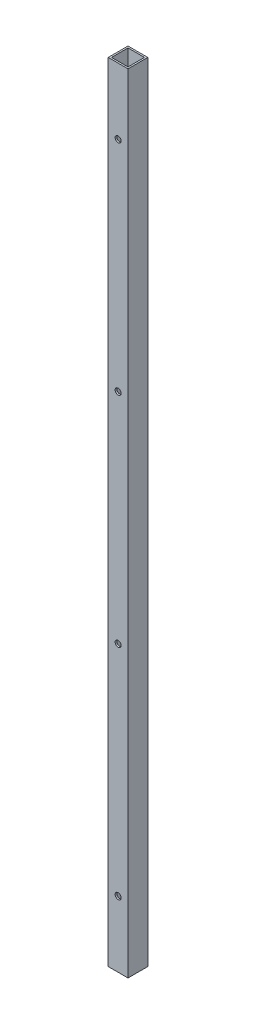
ISO-10303-21;
HEADER;
FILE_DESCRIPTION(('STEP AP214'),'2;1');
FILE_NAME('part.step','',(''),(''),'','','');
FILE_SCHEMA(('AUTOMOTIVE_DESIGN { 1 0 10303 214 1 1 1 1 }'));
ENDSEC;
DATA;
#1=APPLICATION_CONTEXT('core data for automotive mechanical design processes');
#2=APPLICATION_PROTOCOL_DEFINITION('international standard','automotive_design',2000,#1);
#3=PRODUCT_CONTEXT('',#1,'mechanical');
#4=PRODUCT('Part','Part','',(#3));
#5=PRODUCT_RELATED_PRODUCT_CATEGORY('part','',(#4));
#6=PRODUCT_DEFINITION_FORMATION('','',#4);
#7=PRODUCT_DEFINITION_CONTEXT('part definition',#1,'design');
#8=PRODUCT_DEFINITION('design','',#6,#7);
#9=PRODUCT_DEFINITION_SHAPE('','',#8);
#10=(LENGTH_UNIT() NAMED_UNIT(*) SI_UNIT(.MILLI.,.METRE.));
#11=(NAMED_UNIT(*) PLANE_ANGLE_UNIT() SI_UNIT($,.RADIAN.));
#12=(NAMED_UNIT(*) SI_UNIT($,.STERADIAN.) SOLID_ANGLE_UNIT());
#13=UNCERTAINTY_MEASURE_WITH_UNIT(LENGTH_MEASURE(1.E-05),#10,'distance_accuracy_value','');
#14=(GEOMETRIC_REPRESENTATION_CONTEXT(3) GLOBAL_UNCERTAINTY_ASSIGNED_CONTEXT((#13)) GLOBAL_UNIT_ASSIGNED_CONTEXT((#10,
#11,#12)) REPRESENTATION_CONTEXT('',''));
#15=CARTESIAN_POINT('',(0.,0.,0.));
#16=DIRECTION('',(0.,0.,1.));
#17=DIRECTION('',(1.,0.,0.));
#18=AXIS2_PLACEMENT_3D('',#15,#16,#17);
#19=CARTESIAN_POINT('',(0.,63.6015999999999,-9.525));
#20=DIRECTION('',(0.,0.,1.));
#21=DIRECTION('',(1.,0.,0.));
#22=AXIS2_PLACEMENT_3D('',#19,#20,#21);
#23=CYLINDRICAL_SURFACE('',#22,2.89559999999993);
#24=CARTESIAN_POINT('',(0.,63.6015999999999,7.93749999999999));
#25=DIRECTION('',(0.,0.,-1.));
#26=DIRECTION('',(-1.,0.,0.));
#27=AXIS2_PLACEMENT_3D('',#24,#25,#26);
#28=CIRCLE('',#27,2.89559999999993);
#29=CARTESIAN_POINT('',(-2.89559999999993,63.6015999999999,7.93749999999999));
#30=VERTEX_POINT('',#29);
#31=EDGE_CURVE('E40',#30,#30,#28,.T.);
#32=ORIENTED_EDGE('',*,*,#31,.T.);
#33=EDGE_LOOP('',(#32));
#34=FACE_BOUND('',#33,.T.);
#35=CARTESIAN_POINT('',(0.,63.6015999999999,9.525));
#36=DIRECTION('',(0.,0.,1.));
#37=DIRECTION('',(1.,0.,0.));
#38=AXIS2_PLACEMENT_3D('',#35,#36,#37);
#39=CIRCLE('',#38,2.89559999999993);
#40=CARTESIAN_POINT('',(2.89559999999993,63.6015999999999,9.525));
#41=VERTEX_POINT('',#40);
#42=EDGE_CURVE('E11',#41,#41,#39,.T.);
#43=ORIENTED_EDGE('',*,*,#42,.T.);
#44=EDGE_LOOP('',(#43));
#45=FACE_BOUND('',#44,.T.);
#46=ADVANCED_FACE('F33',(#34,#45),#23,.F.);
#47=CARTESIAN_POINT('',(0.,274.176066666667,-9.525));
#48=DIRECTION('',(0.,0.,1.));
#49=DIRECTION('',(1.,0.,0.));
#50=AXIS2_PLACEMENT_3D('',#47,#48,#49);
#51=CYLINDRICAL_SURFACE('',#50,2.89559999999993);
#52=CARTESIAN_POINT('',(0.,274.176066666667,7.93749999999999));
#53=DIRECTION('',(0.,0.,-1.));
#54=DIRECTION('',(-1.,0.,0.));
#55=AXIS2_PLACEMENT_3D('',#52,#53,#54);
#56=CIRCLE('',#55,2.89559999999993);
#57=CARTESIAN_POINT('',(-2.89559999999993,274.176066666667,7.93749999999999));
#58=VERTEX_POINT('',#57);
#59=EDGE_CURVE('E182',#58,#58,#56,.T.);
#60=ORIENTED_EDGE('',*,*,#59,.T.);
#61=EDGE_LOOP('',(#60));
#62=FACE_BOUND('',#61,.T.);
#63=CARTESIAN_POINT('',(0.,274.176066666667,9.525));
#64=DIRECTION('',(0.,0.,1.));
#65=DIRECTION('',(1.,0.,0.));
#66=AXIS2_PLACEMENT_3D('',#63,#64,#65);
#67=CIRCLE('',#66,2.89559999999993);
#68=CARTESIAN_POINT('',(2.89559999999993,274.176066666667,9.525));
#69=VERTEX_POINT('',#68);
#70=EDGE_CURVE('E185',#69,#69,#67,.T.);
#71=ORIENTED_EDGE('',*,*,#70,.T.);
#72=EDGE_LOOP('',(#71));
#73=FACE_BOUND('',#72,.T.);
#74=ADVANCED_FACE('F210',(#62,#73),#51,.F.);
#75=CARTESIAN_POINT('',(0.,63.6015999999999,-9.525));
#76=DIRECTION('',(0.,0.,1.));
#77=DIRECTION('',(1.,0.,0.));
#78=AXIS2_PLACEMENT_3D('',#75,#76,#77);
#79=CYLINDRICAL_SURFACE('',#78,2.89559999999993);
#80=CARTESIAN_POINT('',(0.,63.6015999999999,-7.9375));
#81=DIRECTION('',(0.,0.,1.));
#82=DIRECTION('',(1.,0.,0.));
#83=AXIS2_PLACEMENT_3D('',#80,#81,#82);
#84=CIRCLE('',#83,2.89559999999993);
#85=CARTESIAN_POINT('',(2.89559999999993,63.6015999999999,-7.9375));
#86=VERTEX_POINT('',#85);
#87=EDGE_CURVE('E176',#86,#86,#84,.T.);
#88=ORIENTED_EDGE('',*,*,#87,.T.);
#89=EDGE_LOOP('',(#88));
#90=FACE_BOUND('',#89,.T.);
#91=CARTESIAN_POINT('',(0.,63.6015999999999,-9.525));
#92=DIRECTION('',(0.,0.,1.));
#93=DIRECTION('',(1.,0.,0.));
#94=AXIS2_PLACEMENT_3D('',#91,#92,#93);
#95=CIRCLE('',#94,2.89559999999993);
#96=CARTESIAN_POINT('',(2.89559999999993,63.6015999999999,-9.525));
#97=VERTEX_POINT('',#96);
#98=EDGE_CURVE('E179',#97,#97,#95,.T.);
#99=ORIENTED_EDGE('',*,*,#98,.F.);
#100=EDGE_LOOP('',(#99));
#101=FACE_BOUND('',#100,.T.);
#102=ADVANCED_FACE('F214',(#90,#101),#79,.F.);
#103=CARTESIAN_POINT('',(0.,274.176066666667,-9.525));
#104=DIRECTION('',(0.,0.,1.));
#105=DIRECTION('',(1.,0.,0.));
#106=AXIS2_PLACEMENT_3D('',#103,#104,#105);
#107=CYLINDRICAL_SURFACE('',#106,2.89559999999993);
#108=CARTESIAN_POINT('',(0.,274.176066666667,-7.9375));
#109=DIRECTION('',(0.,0.,1.));
#110=DIRECTION('',(1.,0.,0.));
#111=AXIS2_PLACEMENT_3D('',#108,#109,#110);
#112=CIRCLE('',#111,2.89559999999993);
#113=CARTESIAN_POINT('',(2.89559999999993,274.176066666667,-7.9375));
#114=VERTEX_POINT('',#113);
#115=EDGE_CURVE('E166',#114,#114,#112,.T.);
#116=ORIENTED_EDGE('',*,*,#115,.T.);
#117=EDGE_LOOP('',(#116));
#118=FACE_BOUND('',#117,.T.);
#119=CARTESIAN_POINT('',(0.,274.176066666667,-9.525));
#120=DIRECTION('',(0.,0.,1.));
#121=DIRECTION('',(1.,0.,0.));
#122=AXIS2_PLACEMENT_3D('',#119,#120,#121);
#123=CIRCLE('',#122,2.89559999999993);
#124=CARTESIAN_POINT('',(2.89559999999993,274.176066666667,-9.525));
#125=VERTEX_POINT('',#124);
#126=EDGE_CURVE('E173',#125,#125,#123,.T.);
#127=ORIENTED_EDGE('',*,*,#126,.F.);
#128=EDGE_LOOP('',(#127));
#129=FACE_BOUND('',#128,.T.);
#130=ADVANCED_FACE('F219',(#118,#129),#107,.F.);
#131=CARTESIAN_POINT('',(0.,758.9266,0.));
#132=DIRECTION('',(0.,1.,0.));
#133=DIRECTION('',(0.,0.,1.));
#134=AXIS2_PLACEMENT_3D('',#131,#132,#133);
#135=PLANE('',#134);
#136=DIRECTION('',(0.,0.,-1.));
#137=VECTOR('',#136,1.);
#138=CARTESIAN_POINT('',(9.525,758.9266,-9.525));
#139=LINE('',#138,#137);
#140=CARTESIAN_POINT('',(9.525,758.9266,9.525));
#141=VERTEX_POINT('',#140);
#142=CARTESIAN_POINT('',(9.525,758.9266,-9.525));
#143=VERTEX_POINT('',#142);
#144=EDGE_CURVE('E137',#141,#143,#139,.T.);
#145=ORIENTED_EDGE('',*,*,#144,.T.);
#146=DIRECTION('',(-1.,0.,0.));
#147=VECTOR('',#146,1.);
#148=CARTESIAN_POINT('',(-9.525,758.9266,-9.525));
#149=LINE('',#148,#147);
#150=CARTESIAN_POINT('',(-9.525,758.9266,-9.525));
#151=VERTEX_POINT('',#150);
#152=EDGE_CURVE('E140',#143,#151,#149,.T.);
#153=ORIENTED_EDGE('',*,*,#152,.T.);
#154=DIRECTION('',(0.,0.,1.));
#155=VECTOR('',#154,1.);
#156=CARTESIAN_POINT('',(-9.525,758.9266,-9.525));
#157=LINE('',#156,#155);
#158=CARTESIAN_POINT('',(-9.525,758.9266,9.525));
#159=VERTEX_POINT('',#158);
#160=EDGE_CURVE('E143',#151,#159,#157,.T.);
#161=ORIENTED_EDGE('',*,*,#160,.T.);
#162=DIRECTION('',(1.,0.,0.));
#163=VECTOR('',#162,1.);
#164=CARTESIAN_POINT('',(-9.525,758.9266,9.525));
#165=LINE('',#164,#163);
#166=EDGE_CURVE('E145',#159,#141,#165,.T.);
#167=ORIENTED_EDGE('',*,*,#166,.T.);
#168=EDGE_LOOP('',(#145,#153,#161,#167));
#169=FACE_BOUND('',#168,.T.);
#170=DIRECTION('',(-1.,0.,0.));
#171=VECTOR('',#170,1.);
#172=CARTESIAN_POINT('',(-7.9375,758.9266,-7.9375));
#173=LINE('',#172,#171);
#174=CARTESIAN_POINT('',(7.9375,758.9266,-7.9375));
#175=VERTEX_POINT('',#174);
#176=CARTESIAN_POINT('',(-7.9375,758.9266,-7.9375));
#177=VERTEX_POINT('',#176);
#178=EDGE_CURVE('E105',#175,#177,#173,.T.);
#179=ORIENTED_EDGE('',*,*,#178,.F.);
#180=DIRECTION('',(0.,0.,-1.));
#181=VECTOR('',#180,1.);
#182=CARTESIAN_POINT('',(7.9375,758.9266,-7.9375));
#183=LINE('',#182,#181);
#184=CARTESIAN_POINT('',(7.9375,758.9266,7.9375));
#185=VERTEX_POINT('',#184);
#186=EDGE_CURVE('E97',#185,#175,#183,.T.);
#187=ORIENTED_EDGE('',*,*,#186,.F.);
#188=DIRECTION('',(1.,0.,0.));
#189=VECTOR('',#188,1.);
#190=CARTESIAN_POINT('',(-7.9375,758.9266,7.9375));
#191=LINE('',#190,#189);
#192=CARTESIAN_POINT('',(-7.9375,758.9266,7.9375));
#193=VERTEX_POINT('',#192);
#194=EDGE_CURVE('E121',#193,#185,#191,.T.);
#195=ORIENTED_EDGE('',*,*,#194,.F.);
#196=DIRECTION('',(0.,0.,1.));
#197=VECTOR('',#196,1.);
#198=CARTESIAN_POINT('',(-7.9375,758.9266,-7.9375));
#199=LINE('',#198,#197);
#200=EDGE_CURVE('E119',#177,#193,#199,.T.);
#201=ORIENTED_EDGE('',*,*,#200,.F.);
#202=EDGE_LOOP('',(#179,#187,#195,#201));
#203=FACE_BOUND('',#202,.T.);
#204=ADVANCED_FACE('F118',(#169,#203),#135,.T.);
#205=CARTESIAN_POINT('',(0.,0.,0.));
#206=DIRECTION('',(0.,1.,0.));
#207=DIRECTION('',(0.,0.,1.));
#208=AXIS2_PLACEMENT_3D('',#205,#206,#207);
#209=PLANE('',#208);
#210=DIRECTION('',(0.,0.,-1.));
#211=VECTOR('',#210,1.);
#212=CARTESIAN_POINT('',(9.525,0.,-9.525));
#213=LINE('',#212,#211);
#214=CARTESIAN_POINT('',(9.525,0.,9.525));
#215=VERTEX_POINT('',#214);
#216=CARTESIAN_POINT('',(9.525,0.,-9.525));
#217=VERTEX_POINT('',#216);
#218=EDGE_CURVE('E114',#215,#217,#213,.T.);
#219=ORIENTED_EDGE('',*,*,#218,.F.);
#220=DIRECTION('',(1.,0.,0.));
#221=VECTOR('',#220,1.);
#222=CARTESIAN_POINT('',(-9.525,0.,9.525));
#223=LINE('',#222,#221);
#224=CARTESIAN_POINT('',(-9.525,0.,9.525));
#225=VERTEX_POINT('',#224);
#226=EDGE_CURVE('E141',#225,#215,#223,.T.);
#227=ORIENTED_EDGE('',*,*,#226,.F.);
#228=DIRECTION('',(0.,0.,1.));
#229=VECTOR('',#228,1.);
#230=CARTESIAN_POINT('',(-9.525,0.,-9.525));
#231=LINE('',#230,#229);
#232=CARTESIAN_POINT('',(-9.525,0.,-9.525));
#233=VERTEX_POINT('',#232);
#234=EDGE_CURVE('E152',#233,#225,#231,.T.);
#235=ORIENTED_EDGE('',*,*,#234,.F.);
#236=DIRECTION('',(-1.,0.,0.));
#237=VECTOR('',#236,1.);
#238=CARTESIAN_POINT('',(-9.525,0.,-9.525));
#239=LINE('',#238,#237);
#240=EDGE_CURVE('E150',#217,#233,#239,.T.);
#241=ORIENTED_EDGE('',*,*,#240,.F.);
#242=EDGE_LOOP('',(#219,#227,#235,#241));
#243=FACE_BOUND('',#242,.T.);
#244=DIRECTION('',(0.,0.,-1.));
#245=VECTOR('',#244,1.);
#246=CARTESIAN_POINT('',(7.9375,0.,-7.9375));
#247=LINE('',#246,#245);
#248=CARTESIAN_POINT('',(7.9375,0.,7.9375));
#249=VERTEX_POINT('',#248);
#250=CARTESIAN_POINT('',(7.9375,0.,-7.9375));
#251=VERTEX_POINT('',#250);
#252=EDGE_CURVE('E55',#249,#251,#247,.T.);
#253=ORIENTED_EDGE('',*,*,#252,.T.);
#254=DIRECTION('',(-1.,0.,0.));
#255=VECTOR('',#254,1.);
#256=CARTESIAN_POINT('',(-7.9375,0.,-7.9375));
#257=LINE('',#256,#255);
#258=CARTESIAN_POINT('',(-7.9375,0.,-7.9375));
#259=VERTEX_POINT('',#258);
#260=EDGE_CURVE('E113',#251,#259,#257,.T.);
#261=ORIENTED_EDGE('',*,*,#260,.T.);
#262=DIRECTION('',(0.,0.,1.));
#263=VECTOR('',#262,1.);
#264=CARTESIAN_POINT('',(-7.9375,0.,-7.9375));
#265=LINE('',#264,#263);
#266=CARTESIAN_POINT('',(-7.9375,0.,7.9375));
#267=VERTEX_POINT('',#266);
#268=EDGE_CURVE('E129',#259,#267,#265,.T.);
#269=ORIENTED_EDGE('',*,*,#268,.T.);
#270=DIRECTION('',(1.,0.,0.));
#271=VECTOR('',#270,1.);
#272=CARTESIAN_POINT('',(-7.9375,0.,7.9375));
#273=LINE('',#272,#271);
#274=EDGE_CURVE('E106',#267,#249,#273,.T.);
#275=ORIENTED_EDGE('',*,*,#274,.T.);
#276=EDGE_LOOP('',(#253,#261,#269,#275));
#277=FACE_BOUND('',#276,.T.);
#278=ADVANCED_FACE('F231',(#243,#277),#209,.F.);
#279=CARTESIAN_POINT('',(9.525,758.9266,-9.525));
#280=DIRECTION('',(-1.,0.,0.));
#281=DIRECTION('',(0.,0.,1.));
#282=AXIS2_PLACEMENT_3D('',#279,#280,#281);
#283=PLANE('',#282);
#284=ORIENTED_EDGE('',*,*,#218,.T.);
#285=DIRECTION('',(0.,-1.,0.));
#286=VECTOR('',#285,1.);
#287=CARTESIAN_POINT('',(9.525,758.9266,-9.525));
#288=LINE('',#287,#286);
#289=EDGE_CURVE('E163',#143,#217,#288,.T.);
#290=ORIENTED_EDGE('',*,*,#289,.F.);
#291=ORIENTED_EDGE('',*,*,#144,.F.);
#292=DIRECTION('',(0.,-1.,0.));
#293=VECTOR('',#292,1.);
#294=CARTESIAN_POINT('',(9.525,758.9266,9.525));
#295=LINE('',#294,#293);
#296=EDGE_CURVE('E147',#141,#215,#295,.T.);
#297=ORIENTED_EDGE('',*,*,#296,.T.);
#298=EDGE_LOOP('',(#284,#290,#291,#297));
#299=FACE_BOUND('',#298,.T.);
#300=ADVANCED_FACE('F227',(#299),#283,.F.);
#301=CARTESIAN_POINT('',(-9.525,758.9266,-9.525));
#302=DIRECTION('',(0.,0.,1.));
#303=DIRECTION('',(1.,0.,0.));
#304=AXIS2_PLACEMENT_3D('',#301,#302,#303);
#305=PLANE('',#304);
#306=CARTESIAN_POINT('',(0.,484.750533333333,-9.525));
#307=DIRECTION('',(0.,0.,1.));
#308=DIRECTION('',(1.,0.,0.));
#309=AXIS2_PLACEMENT_3D('',#306,#307,#308);
#310=CIRCLE('',#309,2.89559999999993);
#311=CARTESIAN_POINT('',(2.89559999999993,484.750533333333,-9.525));
#312=VERTEX_POINT('',#311);
#313=EDGE_CURVE('E267',#312,#312,#310,.T.);
#314=ORIENTED_EDGE('',*,*,#313,.T.);
#315=EDGE_LOOP('',(#314));
#316=FACE_BOUND('',#315,.T.);
#317=CARTESIAN_POINT('',(0.,695.325,-9.525));
#318=DIRECTION('',(0.,0.,1.));
#319=DIRECTION('',(1.,0.,0.));
#320=AXIS2_PLACEMENT_3D('',#317,#318,#319);
#321=CIRCLE('',#320,2.89559999999993);
#322=CARTESIAN_POINT('',(2.89559999999993,695.325,-9.525));
#323=VERTEX_POINT('',#322);
#324=EDGE_CURVE('E170',#323,#323,#321,.T.);
#325=ORIENTED_EDGE('',*,*,#324,.T.);
#326=EDGE_LOOP('',(#325));
#327=FACE_BOUND('',#326,.T.);
#328=ORIENTED_EDGE('',*,*,#240,.T.);
#329=DIRECTION('',(0.,-1.,0.));
#330=VECTOR('',#329,1.);
#331=CARTESIAN_POINT('',(-9.525,758.9266,-9.525));
#332=LINE('',#331,#330);
#333=EDGE_CURVE('E160',#151,#233,#332,.T.);
#334=ORIENTED_EDGE('',*,*,#333,.F.);
#335=ORIENTED_EDGE('',*,*,#152,.F.);
#336=ORIENTED_EDGE('',*,*,#289,.T.);
#337=EDGE_LOOP('',(#328,#334,#335,#336));
#338=FACE_BOUND('',#337,.T.);
#339=ORIENTED_EDGE('',*,*,#126,.T.);
#340=EDGE_LOOP('',(#339));
#341=FACE_BOUND('',#340,.T.);
#342=ORIENTED_EDGE('',*,*,#98,.T.);
#343=EDGE_LOOP('',(#342));
#344=FACE_BOUND('',#343,.T.);
#345=ADVANCED_FACE('F230',(#316,#327,#338,#341,#344),#305,.F.);
#346=CARTESIAN_POINT('',(-9.525,758.9266,-9.525));
#347=DIRECTION('',(1.,0.,0.));
#348=DIRECTION('',(0.,0.,-1.));
#349=AXIS2_PLACEMENT_3D('',#346,#347,#348);
#350=PLANE('',#349);
#351=CARTESIAN_POINT('',(-9.525,84.5566,0.));
#352=DIRECTION('',(1.,0.,0.));
#353=DIRECTION('',(0.,0.,-1.));
#354=AXIS2_PLACEMENT_3D('',#351,#352,#353);
#355=CIRCLE('',#354,4.7625);
#356=CARTESIAN_POINT('',(-9.525,84.5566,-4.7625));
#357=VERTEX_POINT('',#356);
#358=EDGE_CURVE('E285',#357,#357,#355,.F.);
#359=ORIENTED_EDGE('',*,*,#358,.F.);
#360=EDGE_LOOP('',(#359));
#361=FACE_BOUND('',#360,.T.);
#362=CARTESIAN_POINT('',(-9.525,674.37,0.));
#363=DIRECTION('',(1.,0.,0.));
#364=DIRECTION('',(0.,0.,-1.));
#365=AXIS2_PLACEMENT_3D('',#362,#363,#364);
#366=CIRCLE('',#365,4.76250000000002);
#367=CARTESIAN_POINT('',(-9.525,674.37,-4.76250000000001));
#368=VERTEX_POINT('',#367);
#369=EDGE_CURVE('E279',#368,#368,#366,.F.);
#370=ORIENTED_EDGE('',*,*,#369,.F.);
#371=EDGE_LOOP('',(#370));
#372=FACE_BOUND('',#371,.T.);
#373=ORIENTED_EDGE('',*,*,#234,.T.);
#374=DIRECTION('',(0.,-1.,0.));
#375=VECTOR('',#374,1.);
#376=CARTESIAN_POINT('',(-9.525,758.9266,9.525));
#377=LINE('',#376,#375);
#378=EDGE_CURVE('E157',#159,#225,#377,.T.);
#379=ORIENTED_EDGE('',*,*,#378,.F.);
#380=ORIENTED_EDGE('',*,*,#160,.F.);
#381=ORIENTED_EDGE('',*,*,#333,.T.);
#382=EDGE_LOOP('',(#373,#379,#380,#381));
#383=FACE_BOUND('',#382,.T.);
#384=ADVANCED_FACE('F235',(#361,#372,#383),#350,.F.);
#385=CARTESIAN_POINT('',(-9.525,758.9266,9.525));
#386=DIRECTION('',(0.,0.,-1.));
#387=DIRECTION('',(-1.,0.,0.));
#388=AXIS2_PLACEMENT_3D('',#385,#386,#387);
#389=PLANE('',#388);
#390=CARTESIAN_POINT('',(0.,484.750533333333,9.525));
#391=DIRECTION('',(0.,0.,1.));
#392=DIRECTION('',(1.,0.,0.));
#393=AXIS2_PLACEMENT_3D('',#390,#391,#392);
#394=CIRCLE('',#393,2.89559999999993);
#395=CARTESIAN_POINT('',(2.89559999999993,484.750533333333,9.525));
#396=VERTEX_POINT('',#395);
#397=EDGE_CURVE('E273',#396,#396,#394,.T.);
#398=ORIENTED_EDGE('',*,*,#397,.F.);
#399=EDGE_LOOP('',(#398));
#400=FACE_BOUND('',#399,.T.);
#401=CARTESIAN_POINT('',(0.,695.325,9.525));
#402=DIRECTION('',(0.,0.,1.));
#403=DIRECTION('',(1.,0.,0.));
#404=AXIS2_PLACEMENT_3D('',#401,#402,#403);
#405=CIRCLE('',#404,2.89559999999993);
#406=CARTESIAN_POINT('',(2.89559999999993,695.325,9.525));
#407=VERTEX_POINT('',#406);
#408=EDGE_CURVE('E264',#407,#407,#405,.T.);
#409=ORIENTED_EDGE('',*,*,#408,.F.);
#410=EDGE_LOOP('',(#409));
#411=FACE_BOUND('',#410,.T.);
#412=ORIENTED_EDGE('',*,*,#226,.T.);
#413=ORIENTED_EDGE('',*,*,#296,.F.);
#414=ORIENTED_EDGE('',*,*,#166,.F.);
#415=ORIENTED_EDGE('',*,*,#378,.T.);
#416=EDGE_LOOP('',(#412,#413,#414,#415));
#417=FACE_BOUND('',#416,.T.);
#418=ORIENTED_EDGE('',*,*,#70,.F.);
#419=EDGE_LOOP('',(#418));
#420=FACE_BOUND('',#419,.T.);
#421=ORIENTED_EDGE('',*,*,#42,.F.);
#422=EDGE_LOOP('',(#421));
#423=FACE_BOUND('',#422,.T.);
#424=ADVANCED_FACE('F239',(#400,#411,#417,#420,#423),#389,.F.);
#425=CARTESIAN_POINT('',(7.9375,758.9266,-7.9375));
#426=DIRECTION('',(-1.,0.,0.));
#427=DIRECTION('',(0.,0.,1.));
#428=AXIS2_PLACEMENT_3D('',#425,#426,#427);
#429=PLANE('',#428);
#430=ORIENTED_EDGE('',*,*,#252,.F.);
#431=DIRECTION('',(0.,-1.,0.));
#432=VECTOR('',#431,1.);
#433=CARTESIAN_POINT('',(7.9375,758.9266,7.9375));
#434=LINE('',#433,#432);
#435=EDGE_CURVE('E101',#185,#249,#434,.T.);
#436=ORIENTED_EDGE('',*,*,#435,.F.);
#437=ORIENTED_EDGE('',*,*,#186,.T.);
#438=DIRECTION('',(0.,-1.,0.));
#439=VECTOR('',#438,1.);
#440=CARTESIAN_POINT('',(7.9375,758.9266,-7.9375));
#441=LINE('',#440,#439);
#442=EDGE_CURVE('E100',#175,#251,#441,.T.);
#443=ORIENTED_EDGE('',*,*,#442,.T.);
#444=EDGE_LOOP('',(#430,#436,#437,#443));
#445=FACE_BOUND('',#444,.T.);
#446=ADVANCED_FACE('F99',(#445),#429,.T.);
#447=CARTESIAN_POINT('',(-7.9375,758.9266,-7.9375));
#448=DIRECTION('',(0.,0.,1.));
#449=DIRECTION('',(1.,0.,0.));
#450=AXIS2_PLACEMENT_3D('',#447,#448,#449);
#451=PLANE('',#450);
#452=CARTESIAN_POINT('',(0.,484.750533333333,-7.9375));
#453=DIRECTION('',(0.,0.,1.));
#454=DIRECTION('',(1.,0.,0.));
#455=AXIS2_PLACEMENT_3D('',#452,#453,#454);
#456=CIRCLE('',#455,2.89559999999993);
#457=CARTESIAN_POINT('',(2.89559999999993,484.750533333333,-7.9375));
#458=VERTEX_POINT('',#457);
#459=EDGE_CURVE('E259',#458,#458,#456,.T.);
#460=ORIENTED_EDGE('',*,*,#459,.F.);
#461=EDGE_LOOP('',(#460));
#462=FACE_BOUND('',#461,.T.);
#463=CARTESIAN_POINT('',(0.,695.325,-7.9375));
#464=DIRECTION('',(0.,0.,1.));
#465=DIRECTION('',(1.,0.,0.));
#466=AXIS2_PLACEMENT_3D('',#463,#464,#465);
#467=CIRCLE('',#466,2.89559999999993);
#468=CARTESIAN_POINT('',(2.89559999999993,695.325,-7.9375));
#469=VERTEX_POINT('',#468);
#470=EDGE_CURVE('E127',#469,#469,#467,.T.);
#471=ORIENTED_EDGE('',*,*,#470,.F.);
#472=EDGE_LOOP('',(#471));
#473=FACE_BOUND('',#472,.T.);
#474=ORIENTED_EDGE('',*,*,#260,.F.);
#475=ORIENTED_EDGE('',*,*,#442,.F.);
#476=ORIENTED_EDGE('',*,*,#178,.T.);
#477=DIRECTION('',(0.,-1.,0.));
#478=VECTOR('',#477,1.);
#479=CARTESIAN_POINT('',(-7.9375,758.9266,-7.9375));
#480=LINE('',#479,#478);
#481=EDGE_CURVE('E115',#177,#259,#480,.T.);
#482=ORIENTED_EDGE('',*,*,#481,.T.);
#483=EDGE_LOOP('',(#474,#475,#476,#482));
#484=FACE_BOUND('',#483,.T.);
#485=ORIENTED_EDGE('',*,*,#115,.F.);
#486=EDGE_LOOP('',(#485));
#487=FACE_BOUND('',#486,.T.);
#488=ORIENTED_EDGE('',*,*,#87,.F.);
#489=EDGE_LOOP('',(#488));
#490=FACE_BOUND('',#489,.T.);
#491=ADVANCED_FACE('F109',(#462,#473,#484,#487,#490),#451,.T.);
#492=CARTESIAN_POINT('',(-7.9375,758.9266,-7.9375));
#493=DIRECTION('',(1.,0.,0.));
#494=DIRECTION('',(0.,0.,-1.));
#495=AXIS2_PLACEMENT_3D('',#492,#493,#494);
#496=PLANE('',#495);
#497=CARTESIAN_POINT('',(-7.9375,84.5566,0.));
#498=DIRECTION('',(1.,0.,0.));
#499=DIRECTION('',(0.,0.,-1.));
#500=AXIS2_PLACEMENT_3D('',#497,#498,#499);
#501=CIRCLE('',#500,4.7625);
#502=CARTESIAN_POINT('',(-7.9375,84.5566,-4.7625));
#503=VERTEX_POINT('',#502);
#504=EDGE_CURVE('E288',#503,#503,#501,.F.);
#505=ORIENTED_EDGE('',*,*,#504,.T.);
#506=EDGE_LOOP('',(#505));
#507=FACE_BOUND('',#506,.T.);
#508=CARTESIAN_POINT('',(-7.9375,674.37,0.));
#509=DIRECTION('',(1.,0.,0.));
#510=DIRECTION('',(0.,0.,-1.));
#511=AXIS2_PLACEMENT_3D('',#508,#509,#510);
#512=CIRCLE('',#511,4.76250000000002);
#513=CARTESIAN_POINT('',(-7.9375,674.37,-4.76250000000001));
#514=VERTEX_POINT('',#513);
#515=EDGE_CURVE('E282',#514,#514,#512,.F.);
#516=ORIENTED_EDGE('',*,*,#515,.T.);
#517=EDGE_LOOP('',(#516));
#518=FACE_BOUND('',#517,.T.);
#519=ORIENTED_EDGE('',*,*,#268,.F.);
#520=ORIENTED_EDGE('',*,*,#481,.F.);
#521=ORIENTED_EDGE('',*,*,#200,.T.);
#522=DIRECTION('',(0.,-1.,0.));
#523=VECTOR('',#522,1.);
#524=CARTESIAN_POINT('',(-7.9375,758.9266,7.9375));
#525=LINE('',#524,#523);
#526=EDGE_CURVE('E47',#193,#267,#525,.T.);
#527=ORIENTED_EDGE('',*,*,#526,.T.);
#528=EDGE_LOOP('',(#519,#520,#521,#527));
#529=FACE_BOUND('',#528,.T.);
#530=ADVANCED_FACE('F195',(#507,#518,#529),#496,.T.);
#531=CARTESIAN_POINT('',(-7.9375,758.9266,7.9375));
#532=DIRECTION('',(0.,0.,-1.));
#533=DIRECTION('',(-1.,0.,0.));
#534=AXIS2_PLACEMENT_3D('',#531,#532,#533);
#535=PLANE('',#534);
#536=CARTESIAN_POINT('',(0.,484.750533333333,7.93749999999999));
#537=DIRECTION('',(0.,0.,-1.));
#538=DIRECTION('',(-1.,0.,0.));
#539=AXIS2_PLACEMENT_3D('',#536,#537,#538);
#540=CIRCLE('',#539,2.89559999999993);
#541=CARTESIAN_POINT('',(-2.89559999999993,484.750533333333,7.93749999999999));
#542=VERTEX_POINT('',#541);
#543=EDGE_CURVE('E276',#542,#542,#540,.T.);
#544=ORIENTED_EDGE('',*,*,#543,.F.);
#545=EDGE_LOOP('',(#544));
#546=FACE_BOUND('',#545,.T.);
#547=CARTESIAN_POINT('',(0.,695.325,7.93749999999999));
#548=DIRECTION('',(0.,0.,-1.));
#549=DIRECTION('',(-1.,0.,0.));
#550=AXIS2_PLACEMENT_3D('',#547,#548,#549);
#551=CIRCLE('',#550,2.89559999999993);
#552=CARTESIAN_POINT('',(-2.89559999999993,695.325,7.93749999999999));
#553=VERTEX_POINT('',#552);
#554=EDGE_CURVE('E167',#553,#553,#551,.T.);
#555=ORIENTED_EDGE('',*,*,#554,.F.);
#556=EDGE_LOOP('',(#555));
#557=FACE_BOUND('',#556,.T.);
#558=ORIENTED_EDGE('',*,*,#274,.F.);
#559=ORIENTED_EDGE('',*,*,#526,.F.);
#560=ORIENTED_EDGE('',*,*,#194,.T.);
#561=ORIENTED_EDGE('',*,*,#435,.T.);
#562=EDGE_LOOP('',(#558,#559,#560,#561));
#563=FACE_BOUND('',#562,.T.);
#564=ORIENTED_EDGE('',*,*,#59,.F.);
#565=EDGE_LOOP('',(#564));
#566=FACE_BOUND('',#565,.T.);
#567=ORIENTED_EDGE('',*,*,#31,.F.);
#568=EDGE_LOOP('',(#567));
#569=FACE_BOUND('',#568,.T.);
#570=ADVANCED_FACE('F192',(#546,#557,#563,#566,#569),#535,.T.);
#571=CARTESIAN_POINT('',(0.,695.325,-9.525));
#572=DIRECTION('',(0.,0.,1.));
#573=DIRECTION('',(1.,0.,0.));
#574=AXIS2_PLACEMENT_3D('',#571,#572,#573);
#575=CYLINDRICAL_SURFACE('',#574,2.89559999999993);
#576=ORIENTED_EDGE('',*,*,#554,.T.);
#577=EDGE_LOOP('',(#576));
#578=FACE_BOUND('',#577,.T.);
#579=ORIENTED_EDGE('',*,*,#408,.T.);
#580=EDGE_LOOP('',(#579));
#581=FACE_BOUND('',#580,.T.);
#582=ADVANCED_FACE('F194',(#578,#581),#575,.F.);
#583=ORIENTED_EDGE('',*,*,#470,.T.);
#584=EDGE_LOOP('',(#583));
#585=FACE_BOUND('',#584,.T.);
#586=ORIENTED_EDGE('',*,*,#324,.F.);
#587=EDGE_LOOP('',(#586));
#588=FACE_BOUND('',#587,.T.);
#589=ADVANCED_FACE('F202',(#585,#588),#575,.F.);
#590=CARTESIAN_POINT('',(0.,484.750533333333,-9.525));
#591=DIRECTION('',(0.,0.,1.));
#592=DIRECTION('',(1.,0.,0.));
#593=AXIS2_PLACEMENT_3D('',#590,#591,#592);
#594=CYLINDRICAL_SURFACE('',#593,2.89559999999993);
#595=ORIENTED_EDGE('',*,*,#459,.T.);
#596=EDGE_LOOP('',(#595));
#597=FACE_BOUND('',#596,.T.);
#598=ORIENTED_EDGE('',*,*,#313,.F.);
#599=EDGE_LOOP('',(#598));
#600=FACE_BOUND('',#599,.T.);
#601=ADVANCED_FACE('F337',(#597,#600),#594,.F.);
#602=CARTESIAN_POINT('',(0.,484.750533333333,-9.525));
#603=DIRECTION('',(0.,0.,1.));
#604=DIRECTION('',(1.,0.,0.));
#605=AXIS2_PLACEMENT_3D('',#602,#603,#604);
#606=CYLINDRICAL_SURFACE('',#605,2.89559999999993);
#607=ORIENTED_EDGE('',*,*,#543,.T.);
#608=EDGE_LOOP('',(#607));
#609=FACE_BOUND('',#608,.T.);
#610=ORIENTED_EDGE('',*,*,#397,.T.);
#611=EDGE_LOOP('',(#610));
#612=FACE_BOUND('',#611,.T.);
#613=ADVANCED_FACE('F331',(#609,#612),#606,.F.);
#614=CARTESIAN_POINT('',(-9.525012,674.37,0.));
#615=DIRECTION('',(1.,0.,0.));
#616=DIRECTION('',(0.,0.,-1.));
#617=AXIS2_PLACEMENT_3D('',#614,#615,#616);
#618=CYLINDRICAL_SURFACE('',#617,4.76250000000002);
#619=ORIENTED_EDGE('',*,*,#515,.F.);
#620=EDGE_LOOP('',(#619));
#621=FACE_BOUND('',#620,.T.);
#622=ORIENTED_EDGE('',*,*,#369,.T.);
#623=EDGE_LOOP('',(#622));
#624=FACE_BOUND('',#623,.T.);
#625=ADVANCED_FACE('F296',(#621,#624),#618,.F.);
#626=CARTESIAN_POINT('',(-9.525012,84.5566,0.));
#627=DIRECTION('',(1.,0.,0.));
#628=DIRECTION('',(0.,0.,-1.));
#629=AXIS2_PLACEMENT_3D('',#626,#627,#628);
#630=CYLINDRICAL_SURFACE('',#629,4.7625);
#631=ORIENTED_EDGE('',*,*,#504,.F.);
#632=EDGE_LOOP('',(#631));
#633=FACE_BOUND('',#632,.T.);
#634=ORIENTED_EDGE('',*,*,#358,.T.);
#635=EDGE_LOOP('',(#634));
#636=FACE_BOUND('',#635,.T.);
#637=ADVANCED_FACE('F293',(#633,#636),#630,.F.);
#638=CLOSED_SHELL('',(#46,#74,#102,#130,#204,#278,#300,#345,#384,#424,#446,#491,#530,#570,#582,
#589,#601,#613,#625,#637));
#639=MANIFOLD_SOLID_BREP('B2',#638);
#640=ADVANCED_BREP_SHAPE_REPRESENTATION('',(#18,#639),#14);
#641=SHAPE_DEFINITION_REPRESENTATION(#9,#640);
ENDSEC;
END-ISO-10303-21;
